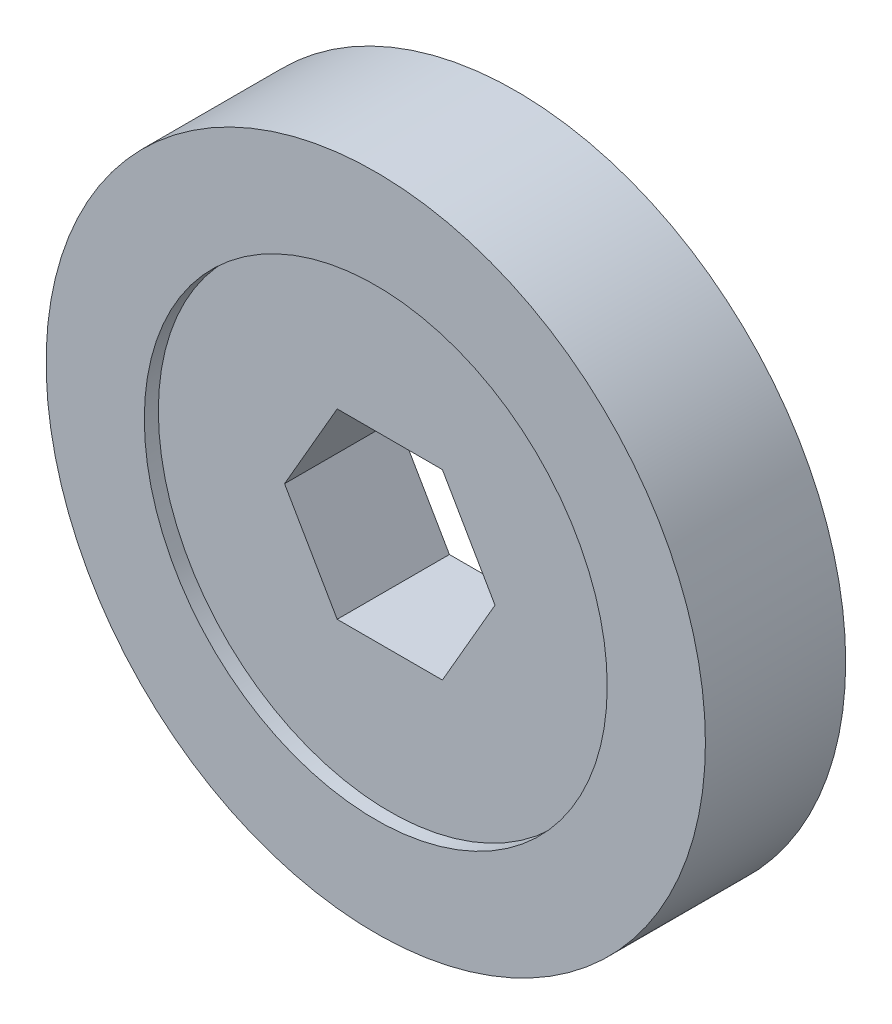
ISO-10303-21;
HEADER;
FILE_DESCRIPTION(('STEP AP214'),'2;1');
FILE_NAME('part.step','',(''),(''),'','','');
FILE_SCHEMA(('AUTOMOTIVE_DESIGN { 1 0 10303 214 1 1 1 1 }'));
ENDSEC;
DATA;
#1=APPLICATION_CONTEXT('core data for automotive mechanical design processes');
#2=APPLICATION_PROTOCOL_DEFINITION('international standard','automotive_design',2000,#1);
#3=PRODUCT_CONTEXT('',#1,'mechanical');
#4=PRODUCT('Part','Part','',(#3));
#5=PRODUCT_RELATED_PRODUCT_CATEGORY('part','',(#4));
#6=PRODUCT_DEFINITION_FORMATION('','',#4);
#7=PRODUCT_DEFINITION_CONTEXT('part definition',#1,'design');
#8=PRODUCT_DEFINITION('design','',#6,#7);
#9=PRODUCT_DEFINITION_SHAPE('','',#8);
#10=(LENGTH_UNIT() NAMED_UNIT(*) SI_UNIT(.MILLI.,.METRE.));
#11=(NAMED_UNIT(*) PLANE_ANGLE_UNIT() SI_UNIT($,.RADIAN.));
#12=(NAMED_UNIT(*) SI_UNIT($,.STERADIAN.) SOLID_ANGLE_UNIT());
#13=UNCERTAINTY_MEASURE_WITH_UNIT(LENGTH_MEASURE(1.E-05),#10,'distance_accuracy_value','');
#14=(GEOMETRIC_REPRESENTATION_CONTEXT(3) GLOBAL_UNCERTAINTY_ASSIGNED_CONTEXT((#13)) GLOBAL_UNIT_ASSIGNED_CONTEXT((#10,
#11,#12)) REPRESENTATION_CONTEXT('',''));
#15=CARTESIAN_POINT('',(0.,0.,0.));
#16=DIRECTION('',(0.,0.,1.));
#17=DIRECTION('',(1.,0.,0.));
#18=AXIS2_PLACEMENT_3D('',#15,#16,#17);
#19=CARTESIAN_POINT('',(-7.50130123279933,0.,0.));
#20=DIRECTION('',(-0.865917691126373,0.500186517405628,0.));
#21=DIRECTION('',(-0.500186517405628,-0.865917691126373,0.));
#22=AXIS2_PLACEMENT_3D('',#19,#20,#21);
#23=PLANE('',#22);
#24=DIRECTION('',(0.,0.,1.));
#25=VECTOR('',#24,1.);
#26=CARTESIAN_POINT('',(-7.50130123279933,0.,0.));
#27=LINE('',#26,#25);
#28=CARTESIAN_POINT('',(-7.50130123279933,0.,1.));
#29=VERTEX_POINT('',#28);
#30=CARTESIAN_POINT('',(-7.50130123279933,0.,9.));
#31=VERTEX_POINT('',#30);
#32=EDGE_CURVE('E105',#29,#31,#27,.T.);
#33=ORIENTED_EDGE('',*,*,#32,.F.);
#34=DIRECTION('',(0.500186517405628,0.865917691126373,0.));
#35=VECTOR('',#34,1.);
#36=CARTESIAN_POINT('',(-7.50130123279933,0.,1.));
#37=LINE('',#36,#35);
#38=CARTESIAN_POINT('',(-3.74971792553224,6.4947019610737,1.));
#39=VERTEX_POINT('',#38);
#40=EDGE_CURVE('E46',#29,#39,#37,.T.);
#41=ORIENTED_EDGE('',*,*,#40,.T.);
#42=DIRECTION('',(0.,0.,1.));
#43=VECTOR('',#42,1.);
#44=CARTESIAN_POINT('',(-3.74971792553224,6.4947019610737,0.));
#45=LINE('',#44,#43);
#46=CARTESIAN_POINT('',(-3.74971792553224,6.4947019610737,9.));
#47=VERTEX_POINT('',#46);
#48=EDGE_CURVE('E108',#39,#47,#45,.T.);
#49=ORIENTED_EDGE('',*,*,#48,.T.);
#50=DIRECTION('',(0.500186517405628,0.865917691126373,0.));
#51=VECTOR('',#50,1.);
#52=CARTESIAN_POINT('',(-7.50130123279933,0.,9.));
#53=LINE('',#52,#51);
#54=EDGE_CURVE('E97',#31,#47,#53,.T.);
#55=ORIENTED_EDGE('',*,*,#54,.F.);
#56=EDGE_LOOP('',(#33,#41,#49,#55));
#57=FACE_BOUND('',#56,.T.);
#58=ADVANCED_FACE('F32',(#57),#23,.F.);
#59=CARTESIAN_POINT('',(-3.74971792553224,6.4947019610737,0.));
#60=DIRECTION('',(-6.5144757897959E-05,0.99999999787808,0.));
#61=DIRECTION('',(-0.99999999787808,-6.5144757897959E-05,0.));
#62=AXIS2_PLACEMENT_3D('',#59,#60,#61);
#63=PLANE('',#62);
#64=ORIENTED_EDGE('',*,*,#48,.F.);
#65=DIRECTION('',(0.99999999787808,6.5144757897959E-05,0.));
#66=VECTOR('',#65,1.);
#67=CARTESIAN_POINT('',(-3.74971792553224,6.4947019610737,1.));
#68=LINE('',#67,#66);
#69=CARTESIAN_POINT('',(3.74999999999998,6.4951905283833,1.));
#70=VERTEX_POINT('',#69);
#71=EDGE_CURVE('E165',#39,#70,#68,.T.);
#72=ORIENTED_EDGE('',*,*,#71,.T.);
#73=DIRECTION('',(0.,0.,1.));
#74=VECTOR('',#73,1.);
#75=CARTESIAN_POINT('',(3.74999999999998,6.4951905283833,0.));
#76=LINE('',#75,#74);
#77=CARTESIAN_POINT('',(3.74999999999998,6.4951905283833,9.));
#78=VERTEX_POINT('',#77);
#79=EDGE_CURVE('E110',#70,#78,#76,.T.);
#80=ORIENTED_EDGE('',*,*,#79,.T.);
#81=DIRECTION('',(0.99999999787808,6.5144757897959E-05,0.));
#82=VECTOR('',#81,1.);
#83=CARTESIAN_POINT('',(-3.74971792553224,6.4947019610737,9.));
#84=LINE('',#83,#82);
#85=EDGE_CURVE('E102',#47,#78,#84,.T.);
#86=ORIENTED_EDGE('',*,*,#85,.F.);
#87=EDGE_LOOP('',(#64,#72,#80,#86));
#88=FACE_BOUND('',#87,.T.);
#89=ADVANCED_FACE('F134',(#88),#63,.F.);
#90=CARTESIAN_POINT('',(3.74999999999998,6.4951905283833,0.));
#91=DIRECTION('',(0.866025403784438,0.500000000000001,0.));
#92=DIRECTION('',(-0.500000000000001,0.866025403784438,0.));
#93=AXIS2_PLACEMENT_3D('',#90,#91,#92);
#94=PLANE('',#93);
#95=ORIENTED_EDGE('',*,*,#79,.F.);
#96=DIRECTION('',(0.500000000000001,-0.866025403784438,0.));
#97=VECTOR('',#96,1.);
#98=CARTESIAN_POINT('',(3.74999999999998,6.4951905283833,1.));
#99=LINE('',#98,#97);
#100=CARTESIAN_POINT('',(7.5,0.,1.));
#101=VERTEX_POINT('',#100);
#102=EDGE_CURVE('E157',#70,#101,#99,.T.);
#103=ORIENTED_EDGE('',*,*,#102,.T.);
#104=DIRECTION('',(0.,0.,1.));
#105=VECTOR('',#104,1.);
#106=CARTESIAN_POINT('',(7.5,0.,0.));
#107=LINE('',#106,#105);
#108=CARTESIAN_POINT('',(7.5,0.,9.));
#109=VERTEX_POINT('',#108);
#110=EDGE_CURVE('E99',#101,#109,#107,.T.);
#111=ORIENTED_EDGE('',*,*,#110,.T.);
#112=DIRECTION('',(0.500000000000001,-0.866025403784438,0.));
#113=VECTOR('',#112,1.);
#114=CARTESIAN_POINT('',(3.74999999999998,6.4951905283833,9.));
#115=LINE('',#114,#113);
#116=EDGE_CURVE('E160',#78,#109,#115,.T.);
#117=ORIENTED_EDGE('',*,*,#116,.F.);
#118=EDGE_LOOP('',(#95,#103,#111,#117));
#119=FACE_BOUND('',#118,.T.);
#120=ADVANCED_FACE('F140',(#119),#94,.F.);
#121=CARTESIAN_POINT('',(3.74999999999998,-6.4951905283833,0.));
#122=DIRECTION('',(-0.866025403784438,0.500000000000001,0.));
#123=DIRECTION('',(-0.500000000000001,-0.866025403784438,0.));
#124=AXIS2_PLACEMENT_3D('',#121,#122,#123);
#125=PLANE('',#124);
#126=DIRECTION('',(0.500000000000001,0.866025403784438,0.));
#127=VECTOR('',#126,1.);
#128=CARTESIAN_POINT('',(3.74999999999998,-6.4951905283833,1.));
#129=LINE('',#128,#127);
#130=CARTESIAN_POINT('',(3.74999999999998,-6.4951905283833,1.));
#131=VERTEX_POINT('',#130);
#132=EDGE_CURVE('E91',#131,#101,#129,.T.);
#133=ORIENTED_EDGE('',*,*,#132,.F.);
#134=DIRECTION('',(0.,0.,1.));
#135=VECTOR('',#134,1.);
#136=CARTESIAN_POINT('',(3.74999999999998,-6.4951905283833,0.));
#137=LINE('',#136,#135);
#138=CARTESIAN_POINT('',(3.74999999999998,-6.4951905283833,9.));
#139=VERTEX_POINT('',#138);
#140=EDGE_CURVE('E90',#131,#139,#137,.T.);
#141=ORIENTED_EDGE('',*,*,#140,.T.);
#142=DIRECTION('',(0.500000000000001,0.866025403784438,0.));
#143=VECTOR('',#142,1.);
#144=CARTESIAN_POINT('',(3.74999999999998,-6.4951905283833,9.));
#145=LINE('',#144,#143);
#146=EDGE_CURVE('E171',#139,#109,#145,.T.);
#147=ORIENTED_EDGE('',*,*,#146,.T.);
#148=ORIENTED_EDGE('',*,*,#110,.F.);
#149=EDGE_LOOP('',(#133,#141,#147,#148));
#150=FACE_BOUND('',#149,.T.);
#151=ADVANCED_FACE('F147',(#150),#125,.T.);
#152=CARTESIAN_POINT('',(-3.74971792553224,-6.4947019610737,0.));
#153=DIRECTION('',(6.5144757897959E-05,0.99999999787808,0.));
#154=DIRECTION('',(-0.99999999787808,6.5144757897959E-05,0.));
#155=AXIS2_PLACEMENT_3D('',#152,#153,#154);
#156=PLANE('',#155);
#157=DIRECTION('',(0.99999999787808,-6.5144757897959E-05,0.));
#158=VECTOR('',#157,1.);
#159=CARTESIAN_POINT('',(-3.74971792553224,-6.4947019610737,1.));
#160=LINE('',#159,#158);
#161=CARTESIAN_POINT('',(-3.74971792553224,-6.4947019610737,1.));
#162=VERTEX_POINT('',#161);
#163=EDGE_CURVE('E84',#162,#131,#160,.T.);
#164=ORIENTED_EDGE('',*,*,#163,.F.);
#165=DIRECTION('',(0.,0.,1.));
#166=VECTOR('',#165,1.);
#167=CARTESIAN_POINT('',(-3.74971792553224,-6.4947019610737,0.));
#168=LINE('',#167,#166);
#169=CARTESIAN_POINT('',(-3.74971792553224,-6.4947019610737,9.));
#170=VERTEX_POINT('',#169);
#171=EDGE_CURVE('E54',#162,#170,#168,.T.);
#172=ORIENTED_EDGE('',*,*,#171,.T.);
#173=DIRECTION('',(0.99999999787808,-6.5144757897959E-05,0.));
#174=VECTOR('',#173,1.);
#175=CARTESIAN_POINT('',(-3.74971792553224,-6.4947019610737,9.));
#176=LINE('',#175,#174);
#177=EDGE_CURVE('E175',#170,#139,#176,.T.);
#178=ORIENTED_EDGE('',*,*,#177,.T.);
#179=ORIENTED_EDGE('',*,*,#140,.F.);
#180=EDGE_LOOP('',(#164,#172,#178,#179));
#181=FACE_BOUND('',#180,.T.);
#182=ADVANCED_FACE('F89',(#181),#156,.T.);
#183=CARTESIAN_POINT('',(-7.50130123279933,0.,0.));
#184=DIRECTION('',(0.865917691126373,0.500186517405628,0.));
#185=DIRECTION('',(-0.500186517405628,0.865917691126373,0.));
#186=AXIS2_PLACEMENT_3D('',#183,#184,#185);
#187=PLANE('',#186);
#188=DIRECTION('',(0.500186517405628,-0.865917691126373,0.));
#189=VECTOR('',#188,1.);
#190=CARTESIAN_POINT('',(-7.50130123279933,0.,1.));
#191=LINE('',#190,#189);
#192=EDGE_CURVE('E11',#29,#162,#191,.T.);
#193=ORIENTED_EDGE('',*,*,#192,.F.);
#194=ORIENTED_EDGE('',*,*,#32,.T.);
#195=DIRECTION('',(0.500186517405628,-0.865917691126373,0.));
#196=VECTOR('',#195,1.);
#197=CARTESIAN_POINT('',(-7.50130123279933,0.,9.));
#198=LINE('',#197,#196);
#199=EDGE_CURVE('E40',#31,#170,#198,.T.);
#200=ORIENTED_EDGE('',*,*,#199,.T.);
#201=ORIENTED_EDGE('',*,*,#171,.F.);
#202=EDGE_LOOP('',(#193,#194,#200,#201));
#203=FACE_BOUND('',#202,.T.);
#204=ADVANCED_FACE('F95',(#203),#187,.T.);
#205=CARTESIAN_POINT('',(0.,0.,10.));
#206=DIRECTION('',(0.,0.,1.));
#207=DIRECTION('',(1.,0.,0.));
#208=AXIS2_PLACEMENT_3D('',#205,#206,#207);
#209=PLANE('',#208);
#210=CARTESIAN_POINT('',(0.,0.,10.));
#211=DIRECTION('',(0.,0.,1.));
#212=DIRECTION('',(1.,0.,0.));
#213=AXIS2_PLACEMENT_3D('',#210,#211,#212);
#214=CIRCLE('',#213,16.5);
#215=CARTESIAN_POINT('',(16.5,0.,10.));
#216=VERTEX_POINT('',#215);
#217=EDGE_CURVE('E178',#216,#216,#214,.T.);
#218=ORIENTED_EDGE('',*,*,#217,.F.);
#219=EDGE_LOOP('',(#218));
#220=FACE_BOUND('',#219,.T.);
#221=CARTESIAN_POINT('',(0.,0.,10.));
#222=DIRECTION('',(0.,0.,1.));
#223=DIRECTION('',(1.,0.,0.));
#224=AXIS2_PLACEMENT_3D('',#221,#222,#223);
#225=CIRCLE('',#224,23.5);
#226=CARTESIAN_POINT('',(23.5,0.,10.));
#227=VERTEX_POINT('',#226);
#228=EDGE_CURVE('E113',#227,#227,#225,.T.);
#229=ORIENTED_EDGE('',*,*,#228,.T.);
#230=EDGE_LOOP('',(#229));
#231=FACE_BOUND('',#230,.T.);
#232=ADVANCED_FACE('F122',(#220,#231),#209,.T.);
#233=CARTESIAN_POINT('',(0.,0.,0.));
#234=DIRECTION('',(0.,0.,1.));
#235=DIRECTION('',(1.,0.,0.));
#236=AXIS2_PLACEMENT_3D('',#233,#234,#235);
#237=PLANE('',#236);
#238=CARTESIAN_POINT('',(0.,0.,0.));
#239=DIRECTION('',(0.,0.,1.));
#240=DIRECTION('',(1.,0.,0.));
#241=AXIS2_PLACEMENT_3D('',#238,#239,#240);
#242=CIRCLE('',#241,16.5);
#243=CARTESIAN_POINT('',(16.5,0.,0.));
#244=VERTEX_POINT('',#243);
#245=EDGE_CURVE('E92',#244,#244,#242,.T.);
#246=ORIENTED_EDGE('',*,*,#245,.T.);
#247=EDGE_LOOP('',(#246));
#248=FACE_BOUND('',#247,.T.);
#249=CARTESIAN_POINT('',(0.,0.,0.));
#250=DIRECTION('',(0.,0.,1.));
#251=DIRECTION('',(1.,0.,0.));
#252=AXIS2_PLACEMENT_3D('',#249,#250,#251);
#253=CIRCLE('',#252,23.5);
#254=CARTESIAN_POINT('',(23.5,0.,0.));
#255=VERTEX_POINT('',#254);
#256=EDGE_CURVE('E107',#255,#255,#253,.T.);
#257=ORIENTED_EDGE('',*,*,#256,.F.);
#258=EDGE_LOOP('',(#257));
#259=FACE_BOUND('',#258,.T.);
#260=ADVANCED_FACE('F120',(#248,#259),#237,.F.);
#261=CARTESIAN_POINT('',(0.,0.,10.));
#262=DIRECTION('',(0.,0.,-1.));
#263=DIRECTION('',(-1.,0.,0.));
#264=AXIS2_PLACEMENT_3D('',#261,#262,#263);
#265=CYLINDRICAL_SURFACE('',#264,23.5);
#266=ORIENTED_EDGE('',*,*,#228,.F.);
#267=EDGE_LOOP('',(#266));
#268=FACE_BOUND('',#267,.T.);
#269=ORIENTED_EDGE('',*,*,#256,.T.);
#270=EDGE_LOOP('',(#269));
#271=FACE_BOUND('',#270,.T.);
#272=ADVANCED_FACE('F34',(#268,#271),#265,.T.);
#273=CARTESIAN_POINT('',(0.,0.,9.));
#274=DIRECTION('',(0.,0.,1.));
#275=DIRECTION('',(1.,0.,0.));
#276=AXIS2_PLACEMENT_3D('',#273,#274,#275);
#277=PLANE('',#276);
#278=CARTESIAN_POINT('',(0.,0.,9.));
#279=DIRECTION('',(0.,0.,1.));
#280=DIRECTION('',(1.,0.,0.));
#281=AXIS2_PLACEMENT_3D('',#278,#279,#280);
#282=CIRCLE('',#281,16.5);
#283=CARTESIAN_POINT('',(16.5,0.,9.));
#284=VERTEX_POINT('',#283);
#285=EDGE_CURVE('E177',#284,#284,#282,.T.);
#286=ORIENTED_EDGE('',*,*,#285,.T.);
#287=EDGE_LOOP('',(#286));
#288=FACE_BOUND('',#287,.T.);
#289=ORIENTED_EDGE('',*,*,#54,.T.);
#290=ORIENTED_EDGE('',*,*,#85,.T.);
#291=ORIENTED_EDGE('',*,*,#116,.T.);
#292=ORIENTED_EDGE('',*,*,#146,.F.);
#293=ORIENTED_EDGE('',*,*,#177,.F.);
#294=ORIENTED_EDGE('',*,*,#199,.F.);
#295=EDGE_LOOP('',(#289,#290,#291,#292,#293,#294));
#296=FACE_BOUND('',#295,.T.);
#297=ADVANCED_FACE('F128',(#288,#296),#277,.T.);
#298=CARTESIAN_POINT('',(0.,0.,9.));
#299=DIRECTION('',(0.,0.,1.));
#300=DIRECTION('',(1.,0.,0.));
#301=AXIS2_PLACEMENT_3D('',#298,#299,#300);
#302=CYLINDRICAL_SURFACE('',#301,16.5);
#303=ORIENTED_EDGE('',*,*,#285,.F.);
#304=EDGE_LOOP('',(#303));
#305=FACE_BOUND('',#304,.T.);
#306=ORIENTED_EDGE('',*,*,#217,.T.);
#307=EDGE_LOOP('',(#306));
#308=FACE_BOUND('',#307,.T.);
#309=ADVANCED_FACE('F199',(#305,#308),#302,.F.);
#310=CARTESIAN_POINT('',(0.,0.,1.));
#311=DIRECTION('',(0.,0.,1.));
#312=DIRECTION('',(1.,0.,0.));
#313=AXIS2_PLACEMENT_3D('',#310,#311,#312);
#314=PLANE('',#313);
#315=CARTESIAN_POINT('',(0.,0.,1.));
#316=DIRECTION('',(0.,0.,1.));
#317=DIRECTION('',(1.,0.,0.));
#318=AXIS2_PLACEMENT_3D('',#315,#316,#317);
#319=CIRCLE('',#318,16.5);
#320=CARTESIAN_POINT('',(16.5,0.,1.));
#321=VERTEX_POINT('',#320);
#322=EDGE_CURVE('E187',#321,#321,#319,.T.);
#323=ORIENTED_EDGE('',*,*,#322,.F.);
#324=EDGE_LOOP('',(#323));
#325=FACE_BOUND('',#324,.T.);
#326=ORIENTED_EDGE('',*,*,#192,.T.);
#327=ORIENTED_EDGE('',*,*,#163,.T.);
#328=ORIENTED_EDGE('',*,*,#132,.T.);
#329=ORIENTED_EDGE('',*,*,#102,.F.);
#330=ORIENTED_EDGE('',*,*,#71,.F.);
#331=ORIENTED_EDGE('',*,*,#40,.F.);
#332=EDGE_LOOP('',(#326,#327,#328,#329,#330,#331));
#333=FACE_BOUND('',#332,.T.);
#334=ADVANCED_FACE('F83',(#325,#333),#314,.F.);
#335=CARTESIAN_POINT('',(0.,0.,0.));
#336=DIRECTION('',(0.,0.,1.));
#337=DIRECTION('',(1.,0.,0.));
#338=AXIS2_PLACEMENT_3D('',#335,#336,#337);
#339=CYLINDRICAL_SURFACE('',#338,16.5);
#340=ORIENTED_EDGE('',*,*,#245,.F.);
#341=EDGE_LOOP('',(#340));
#342=FACE_BOUND('',#341,.T.);
#343=ORIENTED_EDGE('',*,*,#322,.T.);
#344=EDGE_LOOP('',(#343));
#345=FACE_BOUND('',#344,.T.);
#346=ADVANCED_FACE('F192',(#342,#345),#339,.F.);
#347=CLOSED_SHELL('',(#58,#89,#120,#151,#182,#204,#232,#260,#272,#297,#309,#334,#346));
#348=MANIFOLD_SOLID_BREP('B2',#347);
#349=ADVANCED_BREP_SHAPE_REPRESENTATION('',(#18,#348),#14);
#350=SHAPE_DEFINITION_REPRESENTATION(#9,#349);
ENDSEC;
END-ISO-10303-21;
